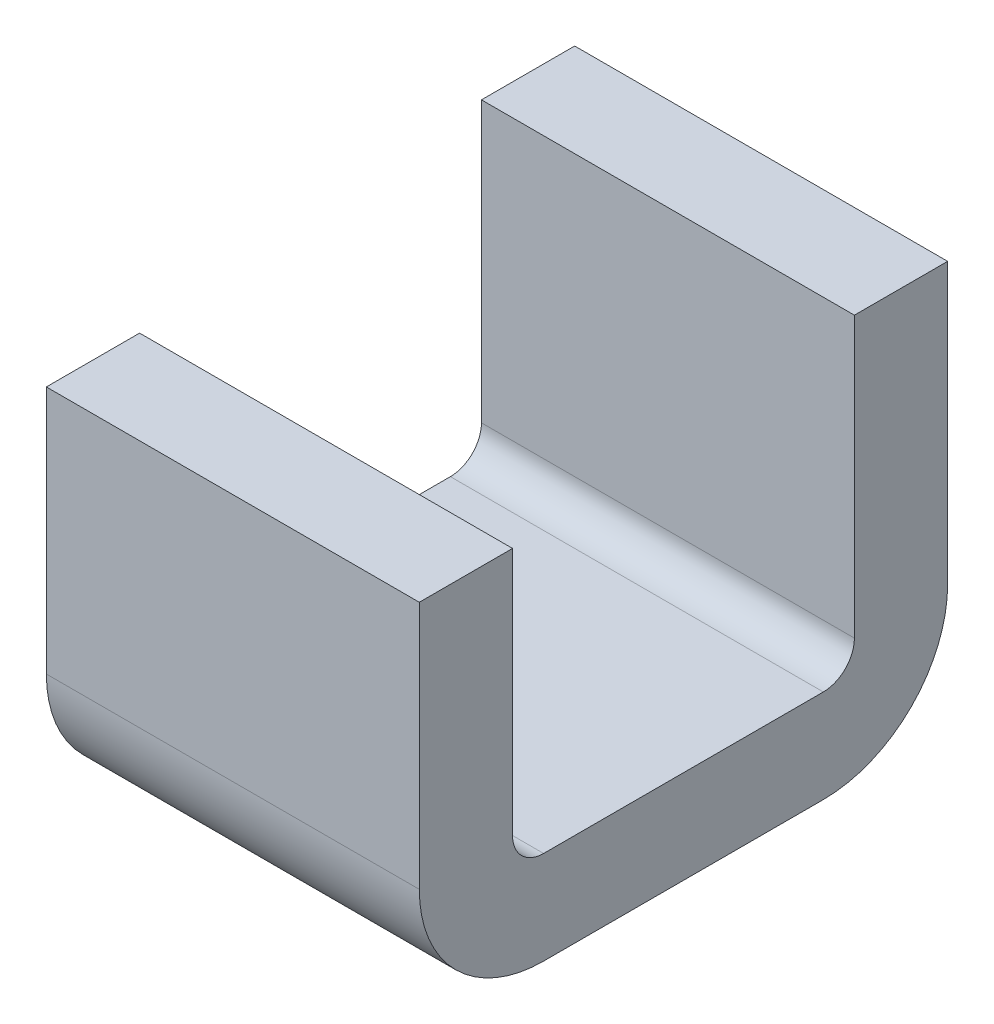
ISO-10303-21;
HEADER;
FILE_DESCRIPTION(('STEP AP214'),'2;1');
FILE_NAME('part.step','',(''),(''),'','','');
FILE_SCHEMA(('AUTOMOTIVE_DESIGN { 1 0 10303 214 1 1 1 1 }'));
ENDSEC;
DATA;
#1=APPLICATION_CONTEXT('core data for automotive mechanical design processes');
#2=APPLICATION_PROTOCOL_DEFINITION('international standard','automotive_design',2000,#1);
#3=PRODUCT_CONTEXT('',#1,'mechanical');
#4=PRODUCT('Part','Part','',(#3));
#5=PRODUCT_RELATED_PRODUCT_CATEGORY('part','',(#4));
#6=PRODUCT_DEFINITION_FORMATION('','',#4);
#7=PRODUCT_DEFINITION_CONTEXT('part definition',#1,'design');
#8=PRODUCT_DEFINITION('design','',#6,#7);
#9=PRODUCT_DEFINITION_SHAPE('','',#8);
#10=(LENGTH_UNIT() NAMED_UNIT(*) SI_UNIT(.MILLI.,.METRE.));
#11=(NAMED_UNIT(*) PLANE_ANGLE_UNIT() SI_UNIT($,.RADIAN.));
#12=(NAMED_UNIT(*) SI_UNIT($,.STERADIAN.) SOLID_ANGLE_UNIT());
#13=UNCERTAINTY_MEASURE_WITH_UNIT(LENGTH_MEASURE(1.E-05),#10,'distance_accuracy_value','');
#14=(GEOMETRIC_REPRESENTATION_CONTEXT(3) GLOBAL_UNCERTAINTY_ASSIGNED_CONTEXT((#13)) GLOBAL_UNIT_ASSIGNED_CONTEXT((#10,
#11,#12)) REPRESENTATION_CONTEXT('',''));
#15=CARTESIAN_POINT('',(0.,0.,0.));
#16=DIRECTION('',(0.,0.,1.));
#17=DIRECTION('',(1.,0.,0.));
#18=AXIS2_PLACEMENT_3D('',#15,#16,#17);
#19=CARTESIAN_POINT('',(-0.7,-2.7,-7.65));
#20=DIRECTION('',(-1.,0.,0.));
#21=DIRECTION('',(0.,0.,1.));
#22=AXIS2_PLACEMENT_3D('',#19,#20,#21);
#23=CYLINDRICAL_SURFACE('',#22,0.0500000000000002);
#24=DIRECTION('',(1.,0.,0.));
#25=VECTOR('',#24,1.);
#26=CARTESIAN_POINT('',(-1.,-2.7,-7.7));
#27=LINE('',#26,#25);
#28=CARTESIAN_POINT('',(-1.3,-2.7,-7.7));
#29=VERTEX_POINT('',#28);
#30=CARTESIAN_POINT('',(-0.7,-2.7,-7.7));
#31=VERTEX_POINT('',#30);
#32=EDGE_CURVE('E164',#29,#31,#27,.T.);
#33=ORIENTED_EDGE('',*,*,#32,.F.);
#34=CARTESIAN_POINT('',(-1.3,-2.7,-7.65));
#35=DIRECTION('',(-1.,0.,0.));
#36=DIRECTION('',(0.,0.,1.));
#37=AXIS2_PLACEMENT_3D('',#34,#35,#36);
#38=CIRCLE('',#37,0.0500000000000002);
#39=CARTESIAN_POINT('',(-1.3,-2.75,-7.65));
#40=VERTEX_POINT('',#39);
#41=EDGE_CURVE('E109',#40,#29,#38,.F.);
#42=ORIENTED_EDGE('',*,*,#41,.F.);
#43=DIRECTION('',(-1.,0.,0.));
#44=VECTOR('',#43,1.);
#45=CARTESIAN_POINT('',(-1.,-2.75,-7.65));
#46=LINE('',#45,#44);
#47=CARTESIAN_POINT('',(-0.7,-2.75,-7.65));
#48=VERTEX_POINT('',#47);
#49=EDGE_CURVE('E106',#48,#40,#46,.T.);
#50=ORIENTED_EDGE('',*,*,#49,.F.);
#51=CARTESIAN_POINT('',(-0.7,-2.7,-7.65));
#52=DIRECTION('',(-1.,0.,0.));
#53=DIRECTION('',(0.,0.,1.));
#54=AXIS2_PLACEMENT_3D('',#51,#52,#53);
#55=CIRCLE('',#54,0.0500000000000002);
#56=EDGE_CURVE('E21',#31,#48,#55,.T.);
#57=ORIENTED_EDGE('',*,*,#56,.F.);
#58=EDGE_LOOP('',(#33,#42,#50,#57));
#59=FACE_BOUND('',#58,.T.);
#60=ADVANCED_FACE('F17',(#59),#23,.F.);
#61=CARTESIAN_POINT('',(-1.301,-2.701,-7.7));
#62=DIRECTION('',(0.,0.,1.));
#63=DIRECTION('',(1.,0.,0.));
#64=AXIS2_PLACEMENT_3D('',#61,#62,#63);
#65=PLANE('',#64);
#66=DIRECTION('',(1.,0.,0.));
#67=VECTOR('',#66,1.);
#68=CARTESIAN_POINT('',(-1.,-2.25,-7.7));
#69=LINE('',#68,#67);
#70=CARTESIAN_POINT('',(-1.3,-2.25,-7.7));
#71=VERTEX_POINT('',#70);
#72=CARTESIAN_POINT('',(-0.7,-2.25,-7.7));
#73=VERTEX_POINT('',#72);
#74=EDGE_CURVE('E153',#71,#73,#69,.T.);
#75=ORIENTED_EDGE('',*,*,#74,.F.);
#76=DIRECTION('',(0.,1.,0.));
#77=VECTOR('',#76,1.);
#78=CARTESIAN_POINT('',(-1.3,-2.575,-7.7));
#79=LINE('',#78,#77);
#80=EDGE_CURVE('E160',#29,#71,#79,.T.);
#81=ORIENTED_EDGE('',*,*,#80,.F.);
#82=ORIENTED_EDGE('',*,*,#32,.T.);
#83=DIRECTION('',(0.,-1.,0.));
#84=VECTOR('',#83,1.);
#85=CARTESIAN_POINT('',(-0.7,-2.575,-7.7));
#86=LINE('',#85,#84);
#87=EDGE_CURVE('E128',#73,#31,#86,.T.);
#88=ORIENTED_EDGE('',*,*,#87,.F.);
#89=EDGE_LOOP('',(#75,#81,#82,#88));
#90=FACE_BOUND('',#89,.T.);
#91=ADVANCED_FACE('F256',(#90),#65,.T.);
#92=CARTESIAN_POINT('',(-0.699,-2.25,-7.851));
#93=DIRECTION('',(0.,1.,0.));
#94=DIRECTION('',(-1.,0.,0.));
#95=AXIS2_PLACEMENT_3D('',#92,#93,#94);
#96=PLANE('',#95);
#97=DIRECTION('',(0.,0.,-1.));
#98=VECTOR('',#97,1.);
#99=CARTESIAN_POINT('',(-1.3,-2.25,-7.425));
#100=LINE('',#99,#98);
#101=CARTESIAN_POINT('',(-1.3,-2.25,-7.85));
#102=VERTEX_POINT('',#101);
#103=EDGE_CURVE('E156',#71,#102,#100,.T.);
#104=ORIENTED_EDGE('',*,*,#103,.F.);
#105=ORIENTED_EDGE('',*,*,#74,.T.);
#106=DIRECTION('',(0.,0.,1.));
#107=VECTOR('',#106,1.);
#108=CARTESIAN_POINT('',(-0.7,-2.25,-7.425));
#109=LINE('',#108,#107);
#110=CARTESIAN_POINT('',(-0.7,-2.25,-7.85));
#111=VERTEX_POINT('',#110);
#112=EDGE_CURVE('E178',#111,#73,#109,.T.);
#113=ORIENTED_EDGE('',*,*,#112,.F.);
#114=DIRECTION('',(1.,0.,0.));
#115=VECTOR('',#114,1.);
#116=CARTESIAN_POINT('',(-1.,-2.25,-7.85));
#117=LINE('',#116,#115);
#118=EDGE_CURVE('E151',#102,#111,#117,.T.);
#119=ORIENTED_EDGE('',*,*,#118,.F.);
#120=EDGE_LOOP('',(#104,#105,#113,#119));
#121=FACE_BOUND('',#120,.T.);
#122=ADVANCED_FACE('F253',(#121),#96,.T.);
#123=CARTESIAN_POINT('',(-0.699,-2.701,-7.85));
#124=DIRECTION('',(0.,0.,-1.));
#125=DIRECTION('',(-1.,0.,0.));
#126=AXIS2_PLACEMENT_3D('',#123,#124,#125);
#127=PLANE('',#126);
#128=ORIENTED_EDGE('',*,*,#118,.T.);
#129=DIRECTION('',(0.,1.,0.));
#130=VECTOR('',#129,1.);
#131=CARTESIAN_POINT('',(-0.7,-2.575,-7.85));
#132=LINE('',#131,#130);
#133=CARTESIAN_POINT('',(-0.7,-2.7,-7.85));
#134=VERTEX_POINT('',#133);
#135=EDGE_CURVE('E180',#134,#111,#132,.T.);
#136=ORIENTED_EDGE('',*,*,#135,.F.);
#137=DIRECTION('',(1.,0.,0.));
#138=VECTOR('',#137,1.);
#139=CARTESIAN_POINT('',(-1.,-2.7,-7.85));
#140=LINE('',#139,#138);
#141=CARTESIAN_POINT('',(-1.3,-2.7,-7.85));
#142=VERTEX_POINT('',#141);
#143=EDGE_CURVE('E149',#142,#134,#140,.T.);
#144=ORIENTED_EDGE('',*,*,#143,.F.);
#145=DIRECTION('',(0.,-1.,0.));
#146=VECTOR('',#145,1.);
#147=CARTESIAN_POINT('',(-1.3,-2.575,-7.85));
#148=LINE('',#147,#146);
#149=EDGE_CURVE('E159',#102,#142,#148,.T.);
#150=ORIENTED_EDGE('',*,*,#149,.F.);
#151=EDGE_LOOP('',(#128,#136,#144,#150));
#152=FACE_BOUND('',#151,.T.);
#153=ADVANCED_FACE('F248',(#152),#127,.T.);
#154=CARTESIAN_POINT('',(-0.7,-2.7,-7.65));
#155=DIRECTION('',(-1.,0.,0.));
#156=DIRECTION('',(0.,0.,1.));
#157=AXIS2_PLACEMENT_3D('',#154,#155,#156);
#158=CYLINDRICAL_SURFACE('',#157,0.2);
#159=CARTESIAN_POINT('',(-0.7,-2.7,-7.65));
#160=DIRECTION('',(-1.,0.,0.));
#161=DIRECTION('',(0.,0.,1.));
#162=AXIS2_PLACEMENT_3D('',#159,#160,#161);
#163=CIRCLE('',#162,0.2);
#164=CARTESIAN_POINT('',(-0.7,-2.9,-7.65));
#165=VERTEX_POINT('',#164);
#166=EDGE_CURVE('E195',#165,#134,#163,.F.);
#167=ORIENTED_EDGE('',*,*,#166,.F.);
#168=DIRECTION('',(1.,0.,0.));
#169=VECTOR('',#168,1.);
#170=CARTESIAN_POINT('',(-1.,-2.9,-7.65));
#171=LINE('',#170,#169);
#172=CARTESIAN_POINT('',(-1.3,-2.9,-7.65));
#173=VERTEX_POINT('',#172);
#174=EDGE_CURVE('E147',#173,#165,#171,.T.);
#175=ORIENTED_EDGE('',*,*,#174,.F.);
#176=CARTESIAN_POINT('',(-1.3,-2.7,-7.65));
#177=DIRECTION('',(-1.,0.,0.));
#178=DIRECTION('',(0.,0.,1.));
#179=AXIS2_PLACEMENT_3D('',#176,#177,#178);
#180=CIRCLE('',#179,0.2);
#181=EDGE_CURVE('E191',#142,#173,#180,.T.);
#182=ORIENTED_EDGE('',*,*,#181,.F.);
#183=ORIENTED_EDGE('',*,*,#143,.T.);
#184=EDGE_LOOP('',(#167,#175,#182,#183));
#185=FACE_BOUND('',#184,.T.);
#186=ADVANCED_FACE('F344',(#185),#158,.T.);
#187=CARTESIAN_POINT('',(-1.301,-2.9,-7.651));
#188=DIRECTION('',(0.,-1.,0.));
#189=DIRECTION('',(1.,0.,0.));
#190=AXIS2_PLACEMENT_3D('',#187,#188,#189);
#191=PLANE('',#190);
#192=DIRECTION('',(1.,0.,0.));
#193=VECTOR('',#192,1.);
#194=CARTESIAN_POINT('',(-1.,-2.9,-7.2));
#195=LINE('',#194,#193);
#196=CARTESIAN_POINT('',(-1.3,-2.9,-7.2));
#197=VERTEX_POINT('',#196);
#198=CARTESIAN_POINT('',(-0.7,-2.9,-7.2));
#199=VERTEX_POINT('',#198);
#200=EDGE_CURVE('E114',#197,#199,#195,.T.);
#201=ORIENTED_EDGE('',*,*,#200,.F.);
#202=DIRECTION('',(0.,0.,1.));
#203=VECTOR('',#202,1.);
#204=CARTESIAN_POINT('',(-1.3,-2.9,-7.425));
#205=LINE('',#204,#203);
#206=EDGE_CURVE('E190',#173,#197,#205,.T.);
#207=ORIENTED_EDGE('',*,*,#206,.F.);
#208=ORIENTED_EDGE('',*,*,#174,.T.);
#209=DIRECTION('',(0.,0.,-1.));
#210=VECTOR('',#209,1.);
#211=CARTESIAN_POINT('',(-0.7,-2.9,-7.425));
#212=LINE('',#211,#210);
#213=EDGE_CURVE('E198',#199,#165,#212,.T.);
#214=ORIENTED_EDGE('',*,*,#213,.F.);
#215=EDGE_LOOP('',(#201,#207,#208,#214));
#216=FACE_BOUND('',#215,.T.);
#217=ADVANCED_FACE('F269',(#216),#191,.T.);
#218=CARTESIAN_POINT('',(-1.3,-2.7,-7.2));
#219=DIRECTION('',(1.,0.,0.));
#220=DIRECTION('',(0.,0.,-1.));
#221=AXIS2_PLACEMENT_3D('',#218,#219,#220);
#222=CYLINDRICAL_SURFACE('',#221,0.2);
#223=CARTESIAN_POINT('',(-0.7,-2.7,-7.2));
#224=DIRECTION('',(1.,0.,0.));
#225=DIRECTION('',(0.,0.,-1.));
#226=AXIS2_PLACEMENT_3D('',#223,#224,#225);
#227=CIRCLE('',#226,0.2);
#228=CARTESIAN_POINT('',(-0.7,-2.7,-7.));
#229=VERTEX_POINT('',#228);
#230=EDGE_CURVE('E199',#229,#199,#227,.T.);
#231=ORIENTED_EDGE('',*,*,#230,.F.);
#232=DIRECTION('',(1.,0.,0.));
#233=VECTOR('',#232,1.);
#234=CARTESIAN_POINT('',(-1.,-2.7,-7.));
#235=LINE('',#234,#233);
#236=CARTESIAN_POINT('',(-1.3,-2.7,-7.));
#237=VERTEX_POINT('',#236);
#238=EDGE_CURVE('E129',#237,#229,#235,.T.);
#239=ORIENTED_EDGE('',*,*,#238,.F.);
#240=CARTESIAN_POINT('',(-1.3,-2.7,-7.2));
#241=DIRECTION('',(1.,0.,0.));
#242=DIRECTION('',(0.,0.,-1.));
#243=AXIS2_PLACEMENT_3D('',#240,#241,#242);
#244=CIRCLE('',#243,0.2);
#245=EDGE_CURVE('E186',#197,#237,#244,.F.);
#246=ORIENTED_EDGE('',*,*,#245,.F.);
#247=ORIENTED_EDGE('',*,*,#200,.T.);
#248=EDGE_LOOP('',(#231,#239,#246,#247));
#249=FACE_BOUND('',#248,.T.);
#250=ADVANCED_FACE('F261',(#249),#222,.T.);
#251=CARTESIAN_POINT('',(-0.7,-2.7,-7.2));
#252=DIRECTION('',(-1.,0.,0.));
#253=DIRECTION('',(0.,0.,1.));
#254=AXIS2_PLACEMENT_3D('',#251,#252,#253);
#255=CYLINDRICAL_SURFACE('',#254,0.0500000000000005);
#256=DIRECTION('',(1.,0.,0.));
#257=VECTOR('',#256,1.);
#258=CARTESIAN_POINT('',(-1.,-2.75,-7.2));
#259=LINE('',#258,#257);
#260=CARTESIAN_POINT('',(-1.3,-2.75,-7.2));
#261=VERTEX_POINT('',#260);
#262=CARTESIAN_POINT('',(-0.7,-2.75,-7.2));
#263=VERTEX_POINT('',#262);
#264=EDGE_CURVE('E113',#261,#263,#259,.T.);
#265=ORIENTED_EDGE('',*,*,#264,.F.);
#266=CARTESIAN_POINT('',(-1.3,-2.7,-7.2));
#267=DIRECTION('',(-1.,0.,0.));
#268=DIRECTION('',(0.,0.,1.));
#269=AXIS2_PLACEMENT_3D('',#266,#267,#268);
#270=CIRCLE('',#269,0.0500000000000005);
#271=CARTESIAN_POINT('',(-1.3,-2.7,-7.15));
#272=VERTEX_POINT('',#271);
#273=EDGE_CURVE('E183',#272,#261,#270,.F.);
#274=ORIENTED_EDGE('',*,*,#273,.F.);
#275=DIRECTION('',(-1.,0.,0.));
#276=VECTOR('',#275,1.);
#277=CARTESIAN_POINT('',(-1.,-2.7,-7.15));
#278=LINE('',#277,#276);
#279=CARTESIAN_POINT('',(-0.7,-2.7,-7.15));
#280=VERTEX_POINT('',#279);
#281=EDGE_CURVE('E171',#280,#272,#278,.T.);
#282=ORIENTED_EDGE('',*,*,#281,.F.);
#283=CARTESIAN_POINT('',(-0.7,-2.7,-7.2));
#284=DIRECTION('',(-1.,0.,0.));
#285=DIRECTION('',(0.,0.,1.));
#286=AXIS2_PLACEMENT_3D('',#283,#284,#285);
#287=CIRCLE('',#286,0.0500000000000005);
#288=EDGE_CURVE('E122',#263,#280,#287,.T.);
#289=ORIENTED_EDGE('',*,*,#288,.F.);
#290=EDGE_LOOP('',(#265,#274,#282,#289));
#291=FACE_BOUND('',#290,.T.);
#292=ADVANCED_FACE('F259',(#291),#255,.F.);
#293=CARTESIAN_POINT('',(-1.301,-2.75,-7.199));
#294=DIRECTION('',(0.,1.,0.));
#295=DIRECTION('',(1.,0.,0.));
#296=AXIS2_PLACEMENT_3D('',#293,#294,#295);
#297=PLANE('',#296);
#298=ORIENTED_EDGE('',*,*,#264,.T.);
#299=DIRECTION('',(0.,0.,1.));
#300=VECTOR('',#299,1.);
#301=CARTESIAN_POINT('',(-0.7,-2.75,-7.425));
#302=LINE('',#301,#300);
#303=EDGE_CURVE('E117',#48,#263,#302,.T.);
#304=ORIENTED_EDGE('',*,*,#303,.F.);
#305=ORIENTED_EDGE('',*,*,#49,.T.);
#306=DIRECTION('',(0.,0.,-1.));
#307=VECTOR('',#306,1.);
#308=CARTESIAN_POINT('',(-1.3,-2.75,-7.425));
#309=LINE('',#308,#307);
#310=EDGE_CURVE('E143',#261,#40,#309,.T.);
#311=ORIENTED_EDGE('',*,*,#310,.F.);
#312=EDGE_LOOP('',(#298,#304,#305,#311));
#313=FACE_BOUND('',#312,.T.);
#314=ADVANCED_FACE('F118',(#313),#297,.T.);
#315=CARTESIAN_POINT('',(-1.301,-2.701,-7.));
#316=DIRECTION('',(0.,0.,1.));
#317=DIRECTION('',(1.,0.,0.));
#318=AXIS2_PLACEMENT_3D('',#315,#316,#317);
#319=PLANE('',#318);
#320=DIRECTION('',(0.,1.,0.));
#321=VECTOR('',#320,1.);
#322=CARTESIAN_POINT('',(-1.3,-2.575,-7.));
#323=LINE('',#322,#321);
#324=CARTESIAN_POINT('',(-1.3,-2.3,-7.));
#325=VERTEX_POINT('',#324);
#326=EDGE_CURVE('E189',#237,#325,#323,.T.);
#327=ORIENTED_EDGE('',*,*,#326,.F.);
#328=ORIENTED_EDGE('',*,*,#238,.T.);
#329=DIRECTION('',(0.,-1.,0.));
#330=VECTOR('',#329,1.);
#331=CARTESIAN_POINT('',(-0.7,-2.575,-7.));
#332=LINE('',#331,#330);
#333=CARTESIAN_POINT('',(-0.7,-2.3,-7.));
#334=VERTEX_POINT('',#333);
#335=EDGE_CURVE('E201',#334,#229,#332,.T.);
#336=ORIENTED_EDGE('',*,*,#335,.F.);
#337=DIRECTION('',(1.,0.,0.));
#338=VECTOR('',#337,1.);
#339=CARTESIAN_POINT('',(-1.,-2.3,-7.));
#340=LINE('',#339,#338);
#341=EDGE_CURVE('E139',#325,#334,#340,.T.);
#342=ORIENTED_EDGE('',*,*,#341,.F.);
#343=EDGE_LOOP('',(#327,#328,#336,#342));
#344=FACE_BOUND('',#343,.T.);
#345=ADVANCED_FACE('F217',(#344),#319,.T.);
#346=CARTESIAN_POINT('',(-0.7,-2.901,-7.851));
#347=DIRECTION('',(1.,0.,0.));
#348=DIRECTION('',(0.,1.,0.));
#349=AXIS2_PLACEMENT_3D('',#346,#347,#348);
#350=PLANE('',#349);
#351=ORIENTED_EDGE('',*,*,#112,.T.);
#352=ORIENTED_EDGE('',*,*,#87,.T.);
#353=ORIENTED_EDGE('',*,*,#56,.T.);
#354=ORIENTED_EDGE('',*,*,#303,.T.);
#355=ORIENTED_EDGE('',*,*,#288,.T.);
#356=DIRECTION('',(0.,-1.,0.));
#357=VECTOR('',#356,1.);
#358=CARTESIAN_POINT('',(-0.7,-2.5,-7.15));
#359=LINE('',#358,#357);
#360=CARTESIAN_POINT('',(-0.7,-2.3,-7.15));
#361=VERTEX_POINT('',#360);
#362=EDGE_CURVE('E168',#361,#280,#359,.T.);
#363=ORIENTED_EDGE('',*,*,#362,.F.);
#364=DIRECTION('',(0.,0.,-1.));
#365=VECTOR('',#364,1.);
#366=CARTESIAN_POINT('',(-0.7,-2.3,-7.075));
#367=LINE('',#366,#365);
#368=EDGE_CURVE('E142',#334,#361,#367,.T.);
#369=ORIENTED_EDGE('',*,*,#368,.F.);
#370=ORIENTED_EDGE('',*,*,#335,.T.);
#371=ORIENTED_EDGE('',*,*,#230,.T.);
#372=ORIENTED_EDGE('',*,*,#213,.T.);
#373=ORIENTED_EDGE('',*,*,#166,.T.);
#374=ORIENTED_EDGE('',*,*,#135,.T.);
#375=EDGE_LOOP('',(#351,#352,#353,#354,#355,#363,#369,#370,#371,#372,#373,#374));
#376=FACE_BOUND('',#375,.T.);
#377=ADVANCED_FACE('F126',(#376),#350,.T.);
#378=CARTESIAN_POINT('',(-0.699,-2.701,-7.15));
#379=DIRECTION('',(0.,0.,-1.));
#380=DIRECTION('',(-1.,0.,0.));
#381=AXIS2_PLACEMENT_3D('',#378,#379,#380);
#382=PLANE('',#381);
#383=DIRECTION('',(-1.,0.,0.));
#384=VECTOR('',#383,1.);
#385=CARTESIAN_POINT('',(-1.,-2.3,-7.15));
#386=LINE('',#385,#384);
#387=CARTESIAN_POINT('',(-1.3,-2.3,-7.15));
#388=VERTEX_POINT('',#387);
#389=EDGE_CURVE('E27',#361,#388,#386,.T.);
#390=ORIENTED_EDGE('',*,*,#389,.F.);
#391=ORIENTED_EDGE('',*,*,#362,.T.);
#392=ORIENTED_EDGE('',*,*,#281,.T.);
#393=DIRECTION('',(0.,-1.,0.));
#394=VECTOR('',#393,1.);
#395=CARTESIAN_POINT('',(-1.3,-2.575,-7.15));
#396=LINE('',#395,#394);
#397=EDGE_CURVE('E36',#388,#272,#396,.T.);
#398=ORIENTED_EDGE('',*,*,#397,.F.);
#399=EDGE_LOOP('',(#390,#391,#392,#398));
#400=FACE_BOUND('',#399,.T.);
#401=ADVANCED_FACE('F214',(#400),#382,.T.);
#402=CARTESIAN_POINT('',(-1.3,-2.249,-7.851));
#403=DIRECTION('',(-1.,0.,0.));
#404=DIRECTION('',(0.,-1.,0.));
#405=AXIS2_PLACEMENT_3D('',#402,#403,#404);
#406=PLANE('',#405);
#407=ORIENTED_EDGE('',*,*,#273,.T.);
#408=ORIENTED_EDGE('',*,*,#310,.T.);
#409=ORIENTED_EDGE('',*,*,#41,.T.);
#410=ORIENTED_EDGE('',*,*,#80,.T.);
#411=ORIENTED_EDGE('',*,*,#103,.T.);
#412=ORIENTED_EDGE('',*,*,#149,.T.);
#413=ORIENTED_EDGE('',*,*,#181,.T.);
#414=ORIENTED_EDGE('',*,*,#206,.T.);
#415=ORIENTED_EDGE('',*,*,#245,.T.);
#416=ORIENTED_EDGE('',*,*,#326,.T.);
#417=DIRECTION('',(0.,0.,1.));
#418=VECTOR('',#417,1.);
#419=CARTESIAN_POINT('',(-1.3,-2.3,-7.075));
#420=LINE('',#419,#418);
#421=EDGE_CURVE('E11',#388,#325,#420,.T.);
#422=ORIENTED_EDGE('',*,*,#421,.F.);
#423=ORIENTED_EDGE('',*,*,#397,.T.);
#424=EDGE_LOOP('',(#407,#408,#409,#410,#411,#412,#413,#414,#415,#416,#422,#423));
#425=FACE_BOUND('',#424,.T.);
#426=ADVANCED_FACE('F219',(#425),#406,.T.);
#427=CARTESIAN_POINT('',(-0.699,-2.3,-7.151));
#428=DIRECTION('',(0.,1.,0.));
#429=DIRECTION('',(-1.,0.,0.));
#430=AXIS2_PLACEMENT_3D('',#427,#428,#429);
#431=PLANE('',#430);
#432=ORIENTED_EDGE('',*,*,#389,.T.);
#433=ORIENTED_EDGE('',*,*,#421,.T.);
#434=ORIENTED_EDGE('',*,*,#341,.T.);
#435=ORIENTED_EDGE('',*,*,#368,.T.);
#436=EDGE_LOOP('',(#432,#433,#434,#435));
#437=FACE_BOUND('',#436,.T.);
#438=ADVANCED_FACE('F19',(#437),#431,.T.);
#439=CLOSED_SHELL('',(#60,#91,#122,#153,#186,#217,#250,#292,#314,#345,#377,#401,#426,#438));
#440=MANIFOLD_SOLID_BREP('B1',#439);
#441=ADVANCED_BREP_SHAPE_REPRESENTATION('',(#18,#440),#14);
#442=SHAPE_DEFINITION_REPRESENTATION(#9,#441);
ENDSEC;
END-ISO-10303-21;
